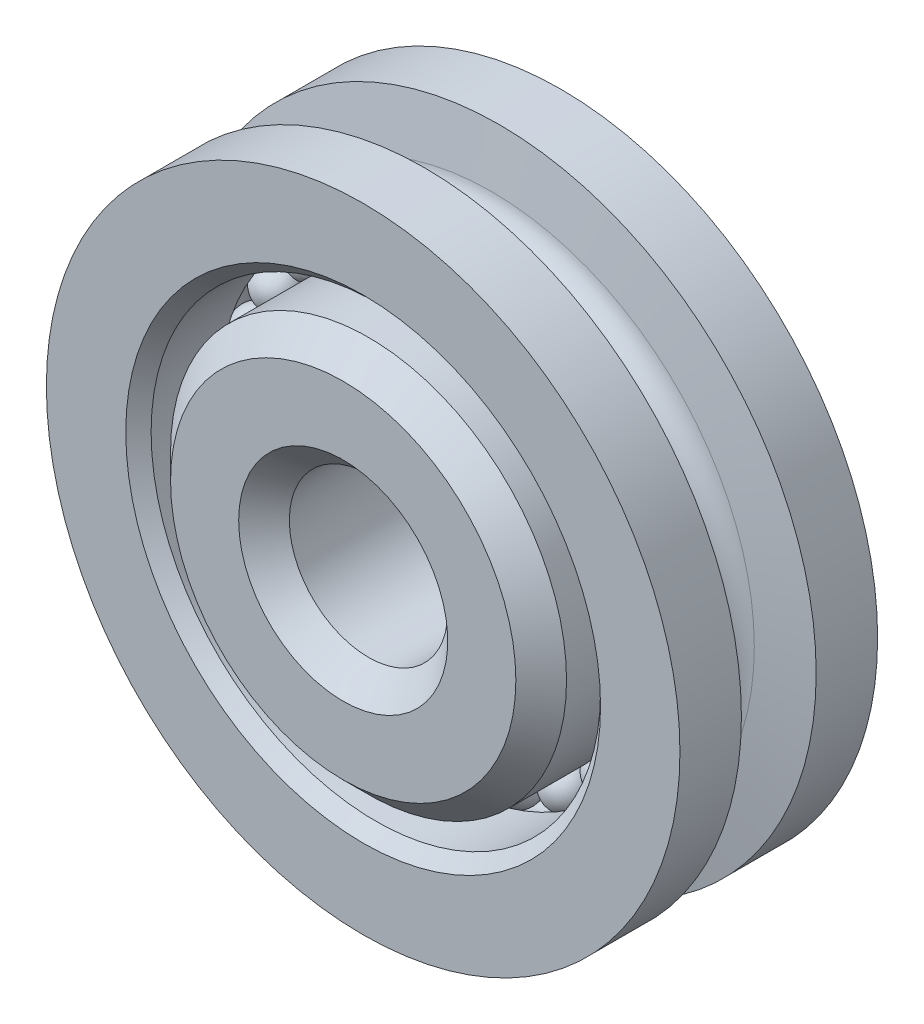
ISO-10303-21;
HEADER;
FILE_DESCRIPTION(('STEP AP214'),'2;1');
FILE_NAME('part.step','',(''),(''),'','','');
FILE_SCHEMA(('AUTOMOTIVE_DESIGN { 1 0 10303 214 1 1 1 1 }'));
ENDSEC;
DATA;
#1=APPLICATION_CONTEXT('core data for automotive mechanical design processes');
#2=APPLICATION_PROTOCOL_DEFINITION('international standard','automotive_design',2000,#1);
#3=PRODUCT_CONTEXT('',#1,'mechanical');
#4=PRODUCT('Part','Part','',(#3));
#5=PRODUCT_RELATED_PRODUCT_CATEGORY('part','',(#4));
#6=PRODUCT_DEFINITION_FORMATION('','',#4);
#7=PRODUCT_DEFINITION_CONTEXT('part definition',#1,'design');
#8=PRODUCT_DEFINITION('design','',#6,#7);
#9=PRODUCT_DEFINITION_SHAPE('','',#8);
#10=(LENGTH_UNIT() NAMED_UNIT(*) SI_UNIT(.MILLI.,.METRE.));
#11=(NAMED_UNIT(*) PLANE_ANGLE_UNIT() SI_UNIT($,.RADIAN.));
#12=(NAMED_UNIT(*) SI_UNIT($,.STERADIAN.) SOLID_ANGLE_UNIT());
#13=UNCERTAINTY_MEASURE_WITH_UNIT(LENGTH_MEASURE(1.E-05),#10,'distance_accuracy_value','');
#14=(GEOMETRIC_REPRESENTATION_CONTEXT(3) GLOBAL_UNCERTAINTY_ASSIGNED_CONTEXT((#13)) GLOBAL_UNIT_ASSIGNED_CONTEXT((#10,
#11,#12)) REPRESENTATION_CONTEXT('',''));
#15=CARTESIAN_POINT('',(0.,0.,0.));
#16=DIRECTION('',(0.,0.,1.));
#17=DIRECTION('',(1.,0.,0.));
#18=AXIS2_PLACEMENT_3D('',#15,#16,#17);
#19=CARTESIAN_POINT('',(1.09652328100499,4.09228059639297,0.));
#20=DIRECTION('',(0.258819045102508,0.965925826289072,0.));
#21=DIRECTION('',(0.,0.,-1.));
#22=AXIS2_PLACEMENT_3D('',#19,#20,#21);
#23=SPHERICAL_SURFACE('',#22,0.446484375);
#24=CARTESIAN_POINT('',(1.21208194059568,4.52355138524001,0.));
#25=VERTEX_POINT('',#24);
#26=VERTEX_LOOP('',#25);
#27=FACE_BOUND('',#26,.T.);
#28=ADVANCED_FACE('F92',(#27),#23,.T.);
#29=CLOSED_SHELL('',(#28));
#30=MANIFOLD_SOLID_BREP('B2',#29);
#31=CARTESIAN_POINT('',(2.11832031249995,3.66903840795521,0.));
#32=DIRECTION('',(0.499999999999989,0.866025403784445,0.));
#33=DIRECTION('',(0.,0.,-1.));
#34=AXIS2_PLACEMENT_3D('',#31,#32,#33);
#35=SPHERICAL_SURFACE('',#34,0.446484375);
#36=CARTESIAN_POINT('',(2.34156249999995,4.05570521909803,0.));
#37=VERTEX_POINT('',#36);
#38=VERTEX_LOOP('',#37);
#39=FACE_BOUND('',#38,.T.);
#40=ADVANCED_FACE('F111',(#39),#35,.T.);
#41=CLOSED_SHELL('',(#40));
#42=MANIFOLD_SOLID_BREP('B7',#41);
#43=CARTESIAN_POINT('',(2.99575731538788,2.99575731538795,0.));
#44=DIRECTION('',(0.707106781186539,0.707106781186556,0.));
#45=DIRECTION('',(0.,0.,-1.));
#46=AXIS2_PLACEMENT_3D('',#43,#44,#45);
#47=SPHERICAL_SURFACE('',#46,0.446484375);
#48=CARTESIAN_POINT('',(3.31146944464421,3.31146944464429,0.));
#49=VERTEX_POINT('',#48);
#50=VERTEX_LOOP('',#49);
#51=FACE_BOUND('',#50,.T.);
#52=ADVANCED_FACE('F130',(#51),#47,.T.);
#53=CLOSED_SHELL('',(#52));
#54=MANIFOLD_SOLID_BREP('B88',#53);
#55=CARTESIAN_POINT('',(3.66903840795516,2.11832031250004,0.));
#56=DIRECTION('',(0.866025403784433,0.50000000000001,0.));
#57=DIRECTION('',(0.,0.,-1.));
#58=AXIS2_PLACEMENT_3D('',#55,#56,#57);
#59=SPHERICAL_SURFACE('',#58,0.446484375);
#60=CARTESIAN_POINT('',(4.05570521909797,2.34156250000005,0.));
#61=VERTEX_POINT('',#60);
#62=VERTEX_LOOP('',#61);
#63=FACE_BOUND('',#62,.T.);
#64=ADVANCED_FACE('F149',(#63),#59,.T.);
#65=CLOSED_SHELL('',(#64));
#66=MANIFOLD_SOLID_BREP('B107',#65);
#67=CARTESIAN_POINT('',(4.09228059639295,1.09652328100509,0.));
#68=DIRECTION('',(0.965925826289065,0.258819045102531,0.));
#69=DIRECTION('',(0.,0.,-1.));
#70=AXIS2_PLACEMENT_3D('',#67,#68,#69);
#71=SPHERICAL_SURFACE('',#70,0.446484375);
#72=CARTESIAN_POINT('',(4.52355138523998,1.21208194059579,0.));
#73=VERTEX_POINT('',#72);
#74=VERTEX_LOOP('',#73);
#75=FACE_BOUND('',#74,.T.);
#76=ADVANCED_FACE('F168',(#75),#71,.T.);
#77=CLOSED_SHELL('',(#76));
#78=MANIFOLD_SOLID_BREP('B126',#77);
#79=CARTESIAN_POINT('',(4.236640625,0.,0.));
#80=DIRECTION('',(1.,0.,0.));
#81=DIRECTION('',(0.,0.,-1.));
#82=AXIS2_PLACEMENT_3D('',#79,#80,#81);
#83=SPHERICAL_SURFACE('',#82,0.446484375);
#84=CARTESIAN_POINT('',(4.683125,0.,0.));
#85=VERTEX_POINT('',#84);
#86=VERTEX_LOOP('',#85);
#87=FACE_BOUND('',#86,.T.);
#88=ADVANCED_FACE('F187',(#87),#83,.T.);
#89=CLOSED_SHELL('',(#88));
#90=MANIFOLD_SOLID_BREP('B145',#89);
#91=CARTESIAN_POINT('',(4.09228059639297,-1.09652328100501,0.));
#92=DIRECTION('',(0.965925826289071,-0.258819045102511,0.));
#93=DIRECTION('',(0.,0.,-1.));
#94=AXIS2_PLACEMENT_3D('',#91,#92,#93);
#95=SPHERICAL_SURFACE('',#94,0.446484375);
#96=CARTESIAN_POINT('',(4.52355138524,-1.2120819405957,0.));
#97=VERTEX_POINT('',#96);
#98=VERTEX_LOOP('',#97);
#99=FACE_BOUND('',#98,.T.);
#100=ADVANCED_FACE('F206',(#99),#95,.T.);
#101=CLOSED_SHELL('',(#100));
#102=MANIFOLD_SOLID_BREP('B164',#101);
#103=CARTESIAN_POINT('',(3.6690384079552,-2.11832031249997,0.));
#104=DIRECTION('',(0.866025403784443,-0.499999999999992,0.));
#105=DIRECTION('',(0.,0.,-1.));
#106=AXIS2_PLACEMENT_3D('',#103,#104,#105);
#107=SPHERICAL_SURFACE('',#106,0.446484375);
#108=CARTESIAN_POINT('',(4.05570521909802,-2.34156249999996,0.));
#109=VERTEX_POINT('',#108);
#110=VERTEX_LOOP('',#109);
#111=FACE_BOUND('',#110,.T.);
#112=ADVANCED_FACE('F225',(#111),#107,.T.);
#113=CLOSED_SHELL('',(#112));
#114=MANIFOLD_SOLID_BREP('B183',#113);
#115=CARTESIAN_POINT('',(2.99575731538794,-2.99575731538789,0.));
#116=DIRECTION('',(0.707106781186554,-0.707106781186541,0.));
#117=DIRECTION('',(0.,0.,-1.));
#118=AXIS2_PLACEMENT_3D('',#115,#116,#117);
#119=SPHERICAL_SURFACE('',#118,0.446484375);
#120=CARTESIAN_POINT('',(3.31146944464428,-3.31146944464422,0.));
#121=VERTEX_POINT('',#120);
#122=VERTEX_LOOP('',#121);
#123=FACE_BOUND('',#122,.T.);
#124=ADVANCED_FACE('F244',(#123),#119,.T.);
#125=CLOSED_SHELL('',(#124));
#126=MANIFOLD_SOLID_BREP('B202',#125);
#127=CARTESIAN_POINT('',(2.11832031250003,-3.66903840795516,0.));
#128=DIRECTION('',(0.500000000000007,-0.866025403784435,0.));
#129=DIRECTION('',(0.,0.,-1.));
#130=AXIS2_PLACEMENT_3D('',#127,#128,#129);
#131=SPHERICAL_SURFACE('',#130,0.446484375);
#132=CARTESIAN_POINT('',(2.34156250000003,-4.05570521909798,0.));
#133=VERTEX_POINT('',#132);
#134=VERTEX_LOOP('',#133);
#135=FACE_BOUND('',#134,.T.);
#136=ADVANCED_FACE('F263',(#135),#131,.T.);
#137=CLOSED_SHELL('',(#136));
#138=MANIFOLD_SOLID_BREP('B221',#137);
#139=CARTESIAN_POINT('',(1.09652328100508,-4.09228059639295,0.));
#140=DIRECTION('',(0.258819045102528,-0.965925826289066,0.));
#141=DIRECTION('',(0.,0.,-1.));
#142=AXIS2_PLACEMENT_3D('',#139,#140,#141);
#143=SPHERICAL_SURFACE('',#142,0.446484375);
#144=CARTESIAN_POINT('',(1.21208194059578,-4.52355138523998,0.));
#145=VERTEX_POINT('',#144);
#146=VERTEX_LOOP('',#145);
#147=FACE_BOUND('',#146,.T.);
#148=ADVANCED_FACE('F282',(#147),#143,.T.);
#149=CLOSED_SHELL('',(#148));
#150=MANIFOLD_SOLID_BREP('B240',#149);
#151=CARTESIAN_POINT('',(0.,-4.236640625,0.));
#152=DIRECTION('',(0.,-1.,0.));
#153=DIRECTION('',(0.,0.,-1.));
#154=AXIS2_PLACEMENT_3D('',#151,#152,#153);
#155=SPHERICAL_SURFACE('',#154,0.446484375);
#156=CARTESIAN_POINT('',(0.,-4.683125,0.));
#157=VERTEX_POINT('',#156);
#158=VERTEX_LOOP('',#157);
#159=FACE_BOUND('',#158,.T.);
#160=ADVANCED_FACE('F301',(#159),#155,.T.);
#161=CLOSED_SHELL('',(#160));
#162=MANIFOLD_SOLID_BREP('B259',#161);
#163=CARTESIAN_POINT('',(-1.09652328100502,-4.09228059639297,0.));
#164=DIRECTION('',(-0.258819045102515,-0.96592582628907,0.));
#165=DIRECTION('',(0.,0.,-1.));
#166=AXIS2_PLACEMENT_3D('',#163,#164,#165);
#167=SPHERICAL_SURFACE('',#166,0.446484375);
#168=CARTESIAN_POINT('',(-1.21208194059571,-4.52355138524,0.));
#169=VERTEX_POINT('',#168);
#170=VERTEX_LOOP('',#169);
#171=FACE_BOUND('',#170,.T.);
#172=ADVANCED_FACE('F320',(#171),#167,.T.);
#173=CLOSED_SHELL('',(#172));
#174=MANIFOLD_SOLID_BREP('B278',#173);
#175=CARTESIAN_POINT('',(-2.11832031249998,-3.66903840795519,0.));
#176=DIRECTION('',(-0.499999999999995,-0.866025403784442,0.));
#177=DIRECTION('',(0.,0.,-1.));
#178=AXIS2_PLACEMENT_3D('',#175,#176,#177);
#179=SPHERICAL_SURFACE('',#178,0.446484375);
#180=CARTESIAN_POINT('',(-2.34156249999998,-4.05570521909801,0.));
#181=VERTEX_POINT('',#180);
#182=VERTEX_LOOP('',#181);
#183=FACE_BOUND('',#182,.T.);
#184=ADVANCED_FACE('F339',(#183),#179,.T.);
#185=CLOSED_SHELL('',(#184));
#186=MANIFOLD_SOLID_BREP('B297',#185);
#187=CARTESIAN_POINT('',(-2.9957573153879,-2.99575731538793,0.));
#188=DIRECTION('',(-0.707106781186544,-0.707106781186551,0.));
#189=DIRECTION('',(0.,0.,-1.));
#190=AXIS2_PLACEMENT_3D('',#187,#188,#189);
#191=SPHERICAL_SURFACE('',#190,0.446484375);
#192=CARTESIAN_POINT('',(-3.31146944464423,-3.31146944464427,0.));
#193=VERTEX_POINT('',#192);
#194=VERTEX_LOOP('',#193);
#195=FACE_BOUND('',#194,.T.);
#196=ADVANCED_FACE('F358',(#195),#191,.T.);
#197=CLOSED_SHELL('',(#196));
#198=MANIFOLD_SOLID_BREP('B316',#197);
#199=CARTESIAN_POINT('',(-3.66903840795517,-2.11832031250002,0.));
#200=DIRECTION('',(-0.866025403784436,-0.500000000000004,0.));
#201=DIRECTION('',(0.,0.,-1.));
#202=AXIS2_PLACEMENT_3D('',#199,#200,#201);
#203=SPHERICAL_SURFACE('',#202,0.446484375);
#204=CARTESIAN_POINT('',(-4.05570521909799,-2.34156250000002,0.));
#205=VERTEX_POINT('',#204);
#206=VERTEX_LOOP('',#205);
#207=FACE_BOUND('',#206,.T.);
#208=ADVANCED_FACE('F377',(#207),#203,.T.);
#209=CLOSED_SHELL('',(#208));
#210=MANIFOLD_SOLID_BREP('B335',#209);
#211=CARTESIAN_POINT('',(-4.09228059639296,-1.09652328100506,0.));
#212=DIRECTION('',(-0.965925826289067,-0.258819045102525,0.));
#213=DIRECTION('',(0.,0.,-1.));
#214=AXIS2_PLACEMENT_3D('',#211,#212,#213);
#215=SPHERICAL_SURFACE('',#214,0.446484375);
#216=CARTESIAN_POINT('',(-4.52355138523999,-1.21208194059576,0.));
#217=VERTEX_POINT('',#216);
#218=VERTEX_LOOP('',#217);
#219=FACE_BOUND('',#218,.T.);
#220=ADVANCED_FACE('F396',(#219),#215,.T.);
#221=CLOSED_SHELL('',(#220));
#222=MANIFOLD_SOLID_BREP('B354',#221);
#223=CARTESIAN_POINT('',(-4.236640625,0.,0.));
#224=DIRECTION('',(-1.,0.,0.));
#225=DIRECTION('',(0.,0.,-1.));
#226=AXIS2_PLACEMENT_3D('',#223,#224,#225);
#227=SPHERICAL_SURFACE('',#226,0.446484375);
#228=CARTESIAN_POINT('',(-4.683125,0.,0.));
#229=VERTEX_POINT('',#228);
#230=VERTEX_LOOP('',#229);
#231=FACE_BOUND('',#230,.T.);
#232=ADVANCED_FACE('F415',(#231),#227,.T.);
#233=CLOSED_SHELL('',(#232));
#234=MANIFOLD_SOLID_BREP('B373',#233);
#235=CARTESIAN_POINT('',(-4.09228059639296,1.09652328100503,0.));
#236=DIRECTION('',(-0.965925826289069,0.258819045102518,0.));
#237=DIRECTION('',(0.,0.,-1.));
#238=AXIS2_PLACEMENT_3D('',#235,#236,#237);
#239=SPHERICAL_SURFACE('',#238,0.446484375);
#240=CARTESIAN_POINT('',(-4.52355138524,1.21208194059573,0.));
#241=VERTEX_POINT('',#240);
#242=VERTEX_LOOP('',#241);
#243=FACE_BOUND('',#242,.T.);
#244=ADVANCED_FACE('F434',(#243),#239,.T.);
#245=CLOSED_SHELL('',(#244));
#246=MANIFOLD_SOLID_BREP('B392',#245);
#247=CARTESIAN_POINT('',(-3.66903840795519,2.11832031249999,0.));
#248=DIRECTION('',(-0.86602540378444,0.499999999999998,0.));
#249=DIRECTION('',(0.,0.,-1.));
#250=AXIS2_PLACEMENT_3D('',#247,#248,#249);
#251=SPHERICAL_SURFACE('',#250,0.446484375);
#252=CARTESIAN_POINT('',(-4.055705219098,2.34156249999999,0.));
#253=VERTEX_POINT('',#252);
#254=VERTEX_LOOP('',#253);
#255=FACE_BOUND('',#254,.T.);
#256=ADVANCED_FACE('F453',(#255),#251,.T.);
#257=CLOSED_SHELL('',(#256));
#258=MANIFOLD_SOLID_BREP('B411',#257);
#259=CARTESIAN_POINT('',(-2.99575731538792,2.99575731538791,0.));
#260=DIRECTION('',(-0.707106781186549,0.707106781186546,0.));
#261=DIRECTION('',(0.,0.,-1.));
#262=AXIS2_PLACEMENT_3D('',#259,#260,#261);
#263=SPHERICAL_SURFACE('',#262,0.446484375);
#264=CARTESIAN_POINT('',(-3.31146944464426,3.31146944464424,0.));
#265=VERTEX_POINT('',#264);
#266=VERTEX_LOOP('',#265);
#267=FACE_BOUND('',#266,.T.);
#268=ADVANCED_FACE('F472',(#267),#263,.T.);
#269=CLOSED_SHELL('',(#268));
#270=MANIFOLD_SOLID_BREP('B430',#269);
#271=CARTESIAN_POINT('',(-2.1183203125,3.66903840795518,0.));
#272=DIRECTION('',(-0.500000000000001,0.866025403784438,0.));
#273=DIRECTION('',(0.,0.,-1.));
#274=AXIS2_PLACEMENT_3D('',#271,#272,#273);
#275=SPHERICAL_SURFACE('',#274,0.446484375);
#276=CARTESIAN_POINT('',(-2.3415625,4.055705219098,0.));
#277=VERTEX_POINT('',#276);
#278=VERTEX_LOOP('',#277);
#279=FACE_BOUND('',#278,.T.);
#280=ADVANCED_FACE('F491',(#279),#275,.T.);
#281=CLOSED_SHELL('',(#280));
#282=MANIFOLD_SOLID_BREP('B449',#281);
#283=CARTESIAN_POINT('',(-1.09652328100505,4.09228059639296,0.));
#284=DIRECTION('',(-0.258819045102521,0.965925826289068,0.));
#285=DIRECTION('',(0.,0.,-1.));
#286=AXIS2_PLACEMENT_3D('',#283,#284,#285);
#287=SPHERICAL_SURFACE('',#286,0.446484375);
#288=CARTESIAN_POINT('',(-1.21208194059575,4.52355138523999,0.));
#289=VERTEX_POINT('',#288);
#290=VERTEX_LOOP('',#289);
#291=FACE_BOUND('',#290,.T.);
#292=ADVANCED_FACE('F510',(#291),#287,.T.);
#293=CLOSED_SHELL('',(#292));
#294=MANIFOLD_SOLID_BREP('B468',#293);
#295=CARTESIAN_POINT('',(0.,4.236640625,0.));
#296=DIRECTION('',(0.,1.,0.));
#297=DIRECTION('',(0.,0.,-1.));
#298=AXIS2_PLACEMENT_3D('',#295,#296,#297);
#299=SPHERICAL_SURFACE('',#298,0.446484375);
#300=CARTESIAN_POINT('',(0.,4.683125,0.));
#301=VERTEX_POINT('',#300);
#302=VERTEX_LOOP('',#301);
#303=FACE_BOUND('',#302,.T.);
#304=ADVANCED_FACE('F531',(#303),#299,.T.);
#305=CLOSED_SHELL('',(#304));
#306=MANIFOLD_SOLID_BREP('B487',#305);
#307=CARTESIAN_POINT('',(0.,3.96875,2.38125));
#308=DIRECTION('',(0.,0.,-1.));
#309=DIRECTION('',(-1.,0.,0.));
#310=AXIS2_PLACEMENT_3D('',#307,#308,#309);
#311=PLANE('',#310);
#312=CARTESIAN_POINT('',(0.,0.,2.38125));
#313=DIRECTION('',(0.,0.,-1.));
#314=DIRECTION('',(-1.,0.,0.));
#315=AXIS2_PLACEMENT_3D('',#312,#313,#314);
#316=CIRCLE('',#315,3.46075);
#317=CARTESIAN_POINT('',(-3.46075,0.,2.38125));
#318=VERTEX_POINT('',#317);
#319=EDGE_CURVE('E559',#318,#318,#316,.F.);
#320=ORIENTED_EDGE('',*,*,#319,.T.);
#321=EDGE_LOOP('',(#320));
#322=FACE_BOUND('',#321,.T.);
#323=CARTESIAN_POINT('',(0.,0.,2.38125));
#324=DIRECTION('',(0.,0.,-1.));
#325=DIRECTION('',(-1.,0.,0.));
#326=AXIS2_PLACEMENT_3D('',#323,#324,#325);
#327=CIRCLE('',#326,2.09550000000001);
#328=CARTESIAN_POINT('',(-2.09550000000001,0.,2.38125));
#329=VERTEX_POINT('',#328);
#330=EDGE_CURVE('E565',#329,#329,#327,.T.);
#331=ORIENTED_EDGE('',*,*,#330,.T.);
#332=EDGE_LOOP('',(#331));
#333=FACE_BOUND('',#332,.T.);
#334=ADVANCED_FACE('F551',(#322,#333),#311,.F.);
#335=CARTESIAN_POINT('',(0.,0.,2.38125));
#336=DIRECTION('',(0.,0.,1.));
#337=DIRECTION('',(1.,0.,0.));
#338=AXIS2_PLACEMENT_3D('',#335,#336,#337);
#339=CYLINDRICAL_SURFACE('',#338,1.5875);
#340=CARTESIAN_POINT('',(0.,0.,-1.87325));
#341=DIRECTION('',(0.,0.,1.));
#342=DIRECTION('',(1.,0.,0.));
#343=AXIS2_PLACEMENT_3D('',#340,#341,#342);
#344=CIRCLE('',#343,1.5875);
#345=CARTESIAN_POINT('',(1.5875,0.,-1.87325));
#346=VERTEX_POINT('',#345);
#347=EDGE_CURVE('E577',#346,#346,#344,.F.);
#348=ORIENTED_EDGE('',*,*,#347,.T.);
#349=EDGE_LOOP('',(#348));
#350=FACE_BOUND('',#349,.T.);
#351=CARTESIAN_POINT('',(0.,0.,1.87325));
#352=DIRECTION('',(0.,0.,-1.));
#353=DIRECTION('',(-1.,0.,0.));
#354=AXIS2_PLACEMENT_3D('',#351,#352,#353);
#355=CIRCLE('',#354,1.5875);
#356=CARTESIAN_POINT('',(-1.5875,0.,1.87325));
#357=VERTEX_POINT('',#356);
#358=EDGE_CURVE('E581',#357,#357,#355,.F.);
#359=ORIENTED_EDGE('',*,*,#358,.T.);
#360=EDGE_LOOP('',(#359));
#361=FACE_BOUND('',#360,.T.);
#362=ADVANCED_FACE('F619',(#350,#361),#339,.F.);
#363=CARTESIAN_POINT('',(0.,3.96875,-2.38125));
#364=DIRECTION('',(0.,0.,1.));
#365=DIRECTION('',(1.,0.,0.));
#366=AXIS2_PLACEMENT_3D('',#363,#364,#365);
#367=PLANE('',#366);
#368=CARTESIAN_POINT('',(0.,0.,-2.38125));
#369=DIRECTION('',(0.,0.,1.));
#370=DIRECTION('',(1.,0.,0.));
#371=AXIS2_PLACEMENT_3D('',#368,#369,#370);
#372=CIRCLE('',#371,2.0955);
#373=CARTESIAN_POINT('',(2.0955,0.,-2.38125));
#374=VERTEX_POINT('',#373);
#375=EDGE_CURVE('E585',#374,#374,#372,.T.);
#376=ORIENTED_EDGE('',*,*,#375,.T.);
#377=EDGE_LOOP('',(#376));
#378=FACE_BOUND('',#377,.T.);
#379=CARTESIAN_POINT('',(0.,0.,-2.38125));
#380=DIRECTION('',(0.,0.,1.));
#381=DIRECTION('',(1.,0.,0.));
#382=AXIS2_PLACEMENT_3D('',#379,#380,#381);
#383=CIRCLE('',#382,3.46075);
#384=CARTESIAN_POINT('',(3.46075,0.,-2.38125));
#385=VERTEX_POINT('',#384);
#386=EDGE_CURVE('E589',#385,#385,#383,.F.);
#387=ORIENTED_EDGE('',*,*,#386,.T.);
#388=EDGE_LOOP('',(#387));
#389=FACE_BOUND('',#388,.T.);
#390=ADVANCED_FACE('F613',(#378,#389),#367,.F.);
#391=CARTESIAN_POINT('',(0.,0.,2.38125));
#392=DIRECTION('',(0.,0.,1.));
#393=DIRECTION('',(1.,0.,0.));
#394=AXIS2_PLACEMENT_3D('',#391,#392,#393);
#395=CYLINDRICAL_SURFACE('',#394,3.96875);
#396=CARTESIAN_POINT('',(0.,0.,-1.87325));
#397=DIRECTION('',(0.,0.,1.));
#398=DIRECTION('',(1.,0.,0.));
#399=AXIS2_PLACEMENT_3D('',#396,#397,#398);
#400=CIRCLE('',#399,3.96875);
#401=CARTESIAN_POINT('',(3.96875,0.,-1.87325));
#402=VERTEX_POINT('',#401);
#403=EDGE_CURVE('E571',#402,#402,#400,.T.);
#404=ORIENTED_EDGE('',*,*,#403,.T.);
#405=EDGE_LOOP('',(#404));
#406=FACE_BOUND('',#405,.T.);
#407=CARTESIAN_POINT('',(0.,0.,-0.3571875));
#408=DIRECTION('',(0.,0.,1.));
#409=DIRECTION('',(1.,0.,0.));
#410=AXIS2_PLACEMENT_3D('',#407,#408,#409);
#411=CIRCLE('',#410,3.96875);
#412=CARTESIAN_POINT('',(3.96875,0.,-0.3571875));
#413=VERTEX_POINT('',#412);
#414=EDGE_CURVE('E593',#413,#413,#411,.T.);
#415=ORIENTED_EDGE('',*,*,#414,.F.);
#416=EDGE_LOOP('',(#415));
#417=FACE_BOUND('',#416,.T.);
#418=ADVANCED_FACE('F608',(#406,#417),#395,.T.);
#419=CARTESIAN_POINT('',(0.,0.,0.));
#420=DIRECTION('',(0.,0.,1.));
#421=DIRECTION('',(1.,0.,0.));
#422=AXIS2_PLACEMENT_3D('',#419,#420,#421);
#423=TOROIDAL_SURFACE('',#422,4.236640625,0.446484375);
#424=CARTESIAN_POINT('',(0.,0.,0.3571875));
#425=DIRECTION('',(0.,0.,1.));
#426=DIRECTION('',(1.,0.,0.));
#427=AXIS2_PLACEMENT_3D('',#424,#425,#426);
#428=CIRCLE('',#427,3.96875);
#429=CARTESIAN_POINT('',(3.96875,0.,0.3571875));
#430=VERTEX_POINT('',#429);
#431=EDGE_CURVE('E597',#430,#430,#428,.T.);
#432=ORIENTED_EDGE('',*,*,#431,.F.);
#433=EDGE_LOOP('',(#432));
#434=FACE_BOUND('',#433,.T.);
#435=ORIENTED_EDGE('',*,*,#414,.T.);
#436=EDGE_LOOP('',(#435));
#437=FACE_BOUND('',#436,.T.);
#438=ADVANCED_FACE('F605',(#434,#437),#423,.F.);
#439=CARTESIAN_POINT('',(0.,0.,2.38125));
#440=DIRECTION('',(0.,0.,1.));
#441=DIRECTION('',(1.,0.,0.));
#442=AXIS2_PLACEMENT_3D('',#439,#440,#441);
#443=CYLINDRICAL_SURFACE('',#442,3.96875);
#444=CARTESIAN_POINT('',(0.,0.,1.87325));
#445=DIRECTION('',(0.,0.,-1.));
#446=DIRECTION('',(-1.,0.,0.));
#447=AXIS2_PLACEMENT_3D('',#444,#445,#446);
#448=CIRCLE('',#447,3.96875);
#449=CARTESIAN_POINT('',(-3.96875,0.,1.87325));
#450=VERTEX_POINT('',#449);
#451=EDGE_CURVE('E530',#450,#450,#448,.T.);
#452=ORIENTED_EDGE('',*,*,#451,.T.);
#453=EDGE_LOOP('',(#452));
#454=FACE_BOUND('',#453,.T.);
#455=ORIENTED_EDGE('',*,*,#431,.T.);
#456=EDGE_LOOP('',(#455));
#457=FACE_BOUND('',#456,.T.);
#458=ADVANCED_FACE('F603',(#454,#457),#443,.T.);
#459=CARTESIAN_POINT('',(0.,0.,-2.38125));
#460=DIRECTION('',(0.,0.,-1.));
#461=DIRECTION('',(-1.,0.,0.));
#462=AXIS2_PLACEMENT_3D('',#459,#460,#461);
#463=CONICAL_SURFACE('',#462,2.0955,0.785398163397447);
#464=ORIENTED_EDGE('',*,*,#347,.F.);
#465=EDGE_LOOP('',(#464));
#466=FACE_BOUND('',#465,.T.);
#467=ORIENTED_EDGE('',*,*,#375,.F.);
#468=EDGE_LOOP('',(#467));
#469=FACE_BOUND('',#468,.T.);
#470=ADVANCED_FACE('F631',(#466,#469),#463,.F.);
#471=CARTESIAN_POINT('',(0.,0.,-1.87325));
#472=DIRECTION('',(0.,0.,1.));
#473=DIRECTION('',(1.,0.,0.));
#474=AXIS2_PLACEMENT_3D('',#471,#472,#473);
#475=CONICAL_SURFACE('',#474,3.96875,0.785398163397451);
#476=ORIENTED_EDGE('',*,*,#386,.F.);
#477=EDGE_LOOP('',(#476));
#478=FACE_BOUND('',#477,.T.);
#479=ORIENTED_EDGE('',*,*,#403,.F.);
#480=EDGE_LOOP('',(#479));
#481=FACE_BOUND('',#480,.T.);
#482=ADVANCED_FACE('F634',(#478,#481),#475,.T.);
#483=CARTESIAN_POINT('',(0.,0.,2.38125));
#484=DIRECTION('',(0.,0.,-1.));
#485=DIRECTION('',(-1.,0.,0.));
#486=AXIS2_PLACEMENT_3D('',#483,#484,#485);
#487=CONICAL_SURFACE('',#486,3.46075,0.785398163397447);
#488=ORIENTED_EDGE('',*,*,#451,.F.);
#489=EDGE_LOOP('',(#488));
#490=FACE_BOUND('',#489,.T.);
#491=ORIENTED_EDGE('',*,*,#319,.F.);
#492=EDGE_LOOP('',(#491));
#493=FACE_BOUND('',#492,.T.);
#494=ADVANCED_FACE('F637',(#490,#493),#487,.T.);
#495=CARTESIAN_POINT('',(0.,0.,1.87325));
#496=DIRECTION('',(0.,0.,1.));
#497=DIRECTION('',(1.,0.,0.));
#498=AXIS2_PLACEMENT_3D('',#495,#496,#497);
#499=CONICAL_SURFACE('',#498,1.5875,0.78539816339745);
#500=ORIENTED_EDGE('',*,*,#330,.F.);
#501=EDGE_LOOP('',(#500));
#502=FACE_BOUND('',#501,.T.);
#503=ORIENTED_EDGE('',*,*,#358,.F.);
#504=EDGE_LOOP('',(#503));
#505=FACE_BOUND('',#504,.T.);
#506=ADVANCED_FACE('F553',(#502,#505),#499,.F.);
#507=CLOSED_SHELL('',(#334,#362,#390,#418,#438,#458,#470,#482,#494,#506));
#508=MANIFOLD_SOLID_BREP('B506',#507);
#509=CARTESIAN_POINT('',(0.,0.,0.));
#510=DIRECTION('',(0.,0.,1.));
#511=DIRECTION('',(1.,0.,0.));
#512=AXIS2_PLACEMENT_3D('',#509,#510,#511);
#513=TOROIDAL_SURFACE('',#512,5.3578125,0.5953125);
#514=CARTESIAN_POINT('',(0.,0.,0.58884564576447));
#515=DIRECTION('',(0.,0.,1.));
#516=DIRECTION('',(1.,0.,0.));
#517=AXIS2_PLACEMENT_3D('',#514,#515,#516);
#518=CIRCLE('',#517,5.27030376831867);
#519=CARTESIAN_POINT('',(5.27030376831867,0.,0.58884564576447));
#520=VERTEX_POINT('',#519);
#521=EDGE_CURVE('E749',#520,#520,#518,.T.);
#522=ORIENTED_EDGE('',*,*,#521,.F.);
#523=EDGE_LOOP('',(#522));
#524=FACE_BOUND('',#523,.T.);
#525=CARTESIAN_POINT('',(0.,0.,-0.58884564576447));
#526=DIRECTION('',(0.,0.,1.));
#527=DIRECTION('',(1.,0.,0.));
#528=AXIS2_PLACEMENT_3D('',#525,#526,#527);
#529=CIRCLE('',#528,5.27030376831867);
#530=CARTESIAN_POINT('',(5.27030376831867,0.,-0.58884564576447));
#531=VERTEX_POINT('',#530);
#532=EDGE_CURVE('E777',#531,#531,#529,.T.);
#533=ORIENTED_EDGE('',*,*,#532,.T.);
#534=EDGE_LOOP('',(#533));
#535=FACE_BOUND('',#534,.T.);
#536=ADVANCED_FACE('F723',(#524,#535),#513,.F.);
#537=CARTESIAN_POINT('',(0.,0.,0.58884564576447));
#538=DIRECTION('',(0.,0.,1.));
#539=DIRECTION('',(1.,0.,0.));
#540=AXIS2_PLACEMENT_3D('',#537,#538,#539);
#541=CONICAL_SURFACE('',#540,5.27030376831867,1.42326543698228);
#542=CARTESIAN_POINT('',(0.,0.,0.7493));
#543=DIRECTION('',(0.,0.,1.));
#544=DIRECTION('',(1.,0.,0.));
#545=AXIS2_PLACEMENT_3D('',#542,#543,#544);
#546=CIRCLE('',#545,6.35);
#547=CARTESIAN_POINT('',(6.35,0.,0.7493));
#548=VERTEX_POINT('',#547);
#549=EDGE_CURVE('E753',#548,#548,#546,.T.);
#550=ORIENTED_EDGE('',*,*,#549,.F.);
#551=EDGE_LOOP('',(#550));
#552=FACE_BOUND('',#551,.T.);
#553=ORIENTED_EDGE('',*,*,#521,.T.);
#554=EDGE_LOOP('',(#553));
#555=FACE_BOUND('',#554,.T.);
#556=ADVANCED_FACE('F809',(#552,#555),#541,.T.);
#557=CARTESIAN_POINT('',(0.,0.,2.38125));
#558=DIRECTION('',(0.,0.,1.));
#559=DIRECTION('',(1.,0.,0.));
#560=AXIS2_PLACEMENT_3D('',#557,#558,#559);
#561=CYLINDRICAL_SURFACE('',#560,6.35);
#562=CARTESIAN_POINT('',(0.,0.,1.9812));
#563=DIRECTION('',(0.,0.,1.));
#564=DIRECTION('',(1.,0.,0.));
#565=AXIS2_PLACEMENT_3D('',#562,#563,#564);
#566=CIRCLE('',#565,6.35);
#567=CARTESIAN_POINT('',(6.35,0.,1.9812));
#568=VERTEX_POINT('',#567);
#569=EDGE_CURVE('E757',#568,#568,#566,.T.);
#570=ORIENTED_EDGE('',*,*,#569,.F.);
#571=EDGE_LOOP('',(#570));
#572=FACE_BOUND('',#571,.T.);
#573=ORIENTED_EDGE('',*,*,#549,.T.);
#574=EDGE_LOOP('',(#573));
#575=FACE_BOUND('',#574,.T.);
#576=ADVANCED_FACE('F815',(#572,#575),#561,.T.);
#577=CARTESIAN_POINT('',(0.,4.50453125,1.9812));
#578=DIRECTION('',(0.,0.,-1.));
#579=DIRECTION('',(-1.,0.,0.));
#580=AXIS2_PLACEMENT_3D('',#577,#578,#579);
#581=PLANE('',#580);
#582=CARTESIAN_POINT('',(0.,0.,1.9812));
#583=DIRECTION('',(0.,0.,-1.));
#584=DIRECTION('',(-1.,0.,0.));
#585=AXIS2_PLACEMENT_3D('',#582,#583,#584);
#586=CIRCLE('',#585,4.75853125);
#587=CARTESIAN_POINT('',(-4.75853125,0.,1.9812));
#588=VERTEX_POINT('',#587);
#589=EDGE_CURVE('E550',#588,#588,#586,.T.);
#590=ORIENTED_EDGE('',*,*,#589,.T.);
#591=EDGE_LOOP('',(#590));
#592=FACE_BOUND('',#591,.T.);
#593=ORIENTED_EDGE('',*,*,#569,.T.);
#594=EDGE_LOOP('',(#593));
#595=FACE_BOUND('',#594,.T.);
#596=ADVANCED_FACE('F839',(#592,#595),#581,.F.);
#597=CARTESIAN_POINT('',(0.,0.,2.38125));
#598=DIRECTION('',(0.,0.,1.));
#599=DIRECTION('',(1.,0.,0.));
#600=AXIS2_PLACEMENT_3D('',#597,#598,#599);
#601=CYLINDRICAL_SURFACE('',#600,4.50453125);
#602=CARTESIAN_POINT('',(0.,0.,1.7272));
#603=DIRECTION('',(0.,0.,-1.));
#604=DIRECTION('',(-1.,0.,0.));
#605=AXIS2_PLACEMENT_3D('',#602,#603,#604);
#606=CIRCLE('',#605,4.50453125);
#607=CARTESIAN_POINT('',(-4.50453125,0.,1.7272));
#608=VERTEX_POINT('',#607);
#609=EDGE_CURVE('E731',#608,#608,#606,.F.);
#610=ORIENTED_EDGE('',*,*,#609,.T.);
#611=EDGE_LOOP('',(#610));
#612=FACE_BOUND('',#611,.T.);
#613=CARTESIAN_POINT('',(0.,0.,0.3571875));
#614=DIRECTION('',(0.,0.,1.));
#615=DIRECTION('',(1.,0.,0.));
#616=AXIS2_PLACEMENT_3D('',#613,#614,#615);
#617=CIRCLE('',#616,4.50453125);
#618=CARTESIAN_POINT('',(4.50453125,0.,0.3571875));
#619=VERTEX_POINT('',#618);
#620=EDGE_CURVE('E761',#619,#619,#617,.T.);
#621=ORIENTED_EDGE('',*,*,#620,.F.);
#622=EDGE_LOOP('',(#621));
#623=FACE_BOUND('',#622,.T.);
#624=ADVANCED_FACE('F834',(#612,#623),#601,.F.);
#625=CARTESIAN_POINT('',(0.,0.,0.));
#626=DIRECTION('',(0.,0.,1.));
#627=DIRECTION('',(1.,0.,0.));
#628=AXIS2_PLACEMENT_3D('',#625,#626,#627);
#629=TOROIDAL_SURFACE('',#628,4.236640625,0.446484375);
#630=CARTESIAN_POINT('',(0.,0.,-0.3571875));
#631=DIRECTION('',(0.,0.,1.));
#632=DIRECTION('',(1.,0.,0.));
#633=AXIS2_PLACEMENT_3D('',#630,#631,#632);
#634=CIRCLE('',#633,4.50453125);
#635=CARTESIAN_POINT('',(4.50453125,0.,-0.3571875));
#636=VERTEX_POINT('',#635);
#637=EDGE_CURVE('E765',#636,#636,#634,.T.);
#638=ORIENTED_EDGE('',*,*,#637,.F.);
#639=EDGE_LOOP('',(#638));
#640=FACE_BOUND('',#639,.T.);
#641=ORIENTED_EDGE('',*,*,#620,.T.);
#642=EDGE_LOOP('',(#641));
#643=FACE_BOUND('',#642,.T.);
#644=ADVANCED_FACE('F805',(#640,#643),#629,.F.);
#645=CARTESIAN_POINT('',(0.,0.,2.38125));
#646=DIRECTION('',(0.,0.,1.));
#647=DIRECTION('',(1.,0.,0.));
#648=AXIS2_PLACEMENT_3D('',#645,#646,#647);
#649=CYLINDRICAL_SURFACE('',#648,4.50453125);
#650=CARTESIAN_POINT('',(0.,0.,-1.7272));
#651=DIRECTION('',(0.,0.,1.));
#652=DIRECTION('',(1.,0.,0.));
#653=AXIS2_PLACEMENT_3D('',#650,#651,#652);
#654=CIRCLE('',#653,4.50453125);
#655=CARTESIAN_POINT('',(4.50453125,0.,-1.7272));
#656=VERTEX_POINT('',#655);
#657=EDGE_CURVE('E737',#656,#656,#654,.F.);
#658=ORIENTED_EDGE('',*,*,#657,.T.);
#659=EDGE_LOOP('',(#658));
#660=FACE_BOUND('',#659,.T.);
#661=ORIENTED_EDGE('',*,*,#637,.T.);
#662=EDGE_LOOP('',(#661));
#663=FACE_BOUND('',#662,.T.);
#664=ADVANCED_FACE('F799',(#660,#663),#649,.F.);
#665=CARTESIAN_POINT('',(0.,6.35,-1.9812));
#666=DIRECTION('',(0.,0.,1.));
#667=DIRECTION('',(1.,0.,0.));
#668=AXIS2_PLACEMENT_3D('',#665,#666,#667);
#669=PLANE('',#668);
#670=CARTESIAN_POINT('',(0.,0.,-1.9812));
#671=DIRECTION('',(0.,0.,1.));
#672=DIRECTION('',(1.,0.,0.));
#673=AXIS2_PLACEMENT_3D('',#670,#671,#672);
#674=CIRCLE('',#673,4.75853125);
#675=CARTESIAN_POINT('',(4.75853125,0.,-1.9812));
#676=VERTEX_POINT('',#675);
#677=EDGE_CURVE('E743',#676,#676,#674,.T.);
#678=ORIENTED_EDGE('',*,*,#677,.T.);
#679=EDGE_LOOP('',(#678));
#680=FACE_BOUND('',#679,.T.);
#681=CARTESIAN_POINT('',(0.,0.,-1.9812));
#682=DIRECTION('',(0.,0.,1.));
#683=DIRECTION('',(1.,0.,0.));
#684=AXIS2_PLACEMENT_3D('',#681,#682,#683);
#685=CIRCLE('',#684,6.35);
#686=CARTESIAN_POINT('',(6.35,0.,-1.9812));
#687=VERTEX_POINT('',#686);
#688=EDGE_CURVE('E769',#687,#687,#685,.T.);
#689=ORIENTED_EDGE('',*,*,#688,.F.);
#690=EDGE_LOOP('',(#689));
#691=FACE_BOUND('',#690,.T.);
#692=ADVANCED_FACE('F794',(#680,#691),#669,.F.);
#693=CARTESIAN_POINT('',(0.,0.,2.38125));
#694=DIRECTION('',(0.,0.,1.));
#695=DIRECTION('',(1.,0.,0.));
#696=AXIS2_PLACEMENT_3D('',#693,#694,#695);
#697=CYLINDRICAL_SURFACE('',#696,6.35);
#698=CARTESIAN_POINT('',(0.,0.,-0.7493));
#699=DIRECTION('',(0.,0.,1.));
#700=DIRECTION('',(1.,0.,0.));
#701=AXIS2_PLACEMENT_3D('',#698,#699,#700);
#702=CIRCLE('',#701,6.35);
#703=CARTESIAN_POINT('',(6.35,0.,-0.7493));
#704=VERTEX_POINT('',#703);
#705=EDGE_CURVE('E773',#704,#704,#702,.T.);
#706=ORIENTED_EDGE('',*,*,#705,.F.);
#707=EDGE_LOOP('',(#706));
#708=FACE_BOUND('',#707,.T.);
#709=ORIENTED_EDGE('',*,*,#688,.T.);
#710=EDGE_LOOP('',(#709));
#711=FACE_BOUND('',#710,.T.);
#712=ADVANCED_FACE('F788',(#708,#711),#697,.T.);
#713=CARTESIAN_POINT('',(0.,0.,-0.7493));
#714=DIRECTION('',(0.,0.,-1.));
#715=DIRECTION('',(-1.,0.,0.));
#716=AXIS2_PLACEMENT_3D('',#713,#714,#715);
#717=CONICAL_SURFACE('',#716,6.35,1.42326543698228);
#718=ORIENTED_EDGE('',*,*,#532,.F.);
#719=EDGE_LOOP('',(#718));
#720=FACE_BOUND('',#719,.T.);
#721=ORIENTED_EDGE('',*,*,#705,.T.);
#722=EDGE_LOOP('',(#721));
#723=FACE_BOUND('',#722,.T.);
#724=ADVANCED_FACE('F784',(#720,#723),#717,.T.);
#725=CARTESIAN_POINT('',(0.,0.,-1.9812));
#726=DIRECTION('',(0.,0.,-1.));
#727=DIRECTION('',(-1.,0.,0.));
#728=AXIS2_PLACEMENT_3D('',#725,#726,#727);
#729=CONICAL_SURFACE('',#728,4.75853125,0.785398163397448);
#730=ORIENTED_EDGE('',*,*,#657,.F.);
#731=EDGE_LOOP('',(#730));
#732=FACE_BOUND('',#731,.T.);
#733=ORIENTED_EDGE('',*,*,#677,.F.);
#734=EDGE_LOOP('',(#733));
#735=FACE_BOUND('',#734,.T.);
#736=ADVANCED_FACE('F787',(#732,#735),#729,.F.);
#737=CARTESIAN_POINT('',(0.,0.,1.7272));
#738=DIRECTION('',(0.,0.,1.));
#739=DIRECTION('',(1.,0.,0.));
#740=AXIS2_PLACEMENT_3D('',#737,#738,#739);
#741=CONICAL_SURFACE('',#740,4.50453125,0.785398163397452);
#742=ORIENTED_EDGE('',*,*,#589,.F.);
#743=EDGE_LOOP('',(#742));
#744=FACE_BOUND('',#743,.T.);
#745=ORIENTED_EDGE('',*,*,#609,.F.);
#746=EDGE_LOOP('',(#745));
#747=FACE_BOUND('',#746,.T.);
#748=ADVANCED_FACE('F725',(#744,#747),#741,.F.);
#749=CLOSED_SHELL('',(#536,#556,#576,#596,#624,#644,#664,#692,#712,#724,#736,#748));
#750=MANIFOLD_SOLID_BREP('B525',#749);
#751=ADVANCED_BREP_SHAPE_REPRESENTATION('',(#18,#30,#42,#54,#66,#78,#90,#102,#114,#126,#138,
#150,#162,#174,#186,#198,#210,#222,#234,#246,#258,#270,#282,#294,#306,#508,#750),#14);
#752=SHAPE_DEFINITION_REPRESENTATION(#9,#751);
ENDSEC;
END-ISO-10303-21;
